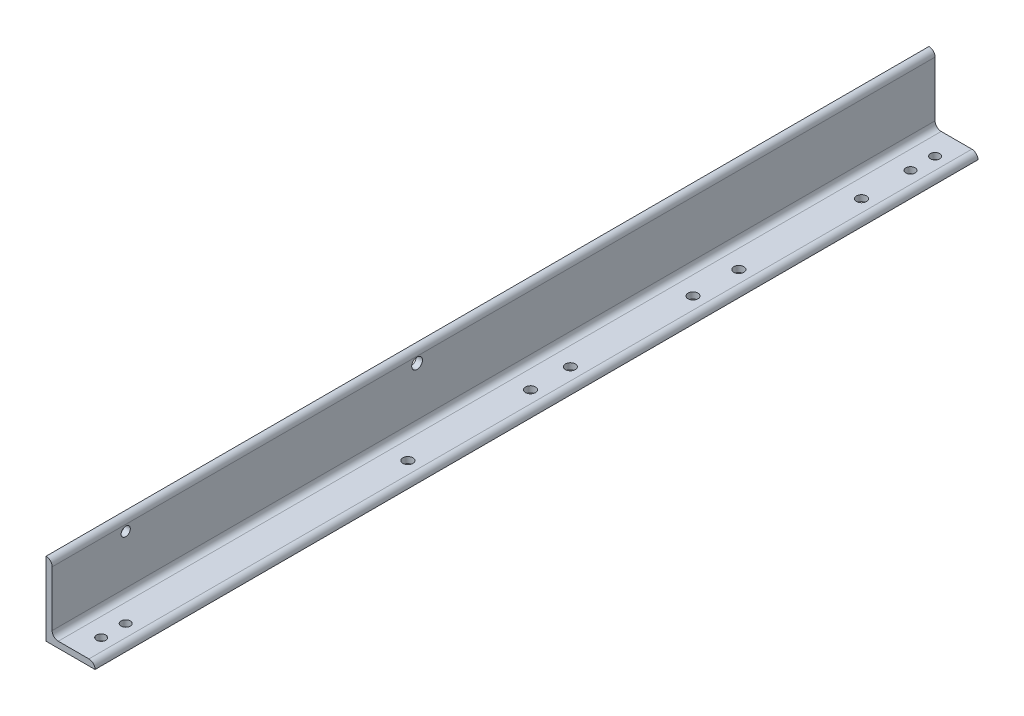
ISO-10303-21;
HEADER;
FILE_DESCRIPTION(('STEP AP214'),'2;1');
FILE_NAME('part.step','',(''),(''),'','','');
FILE_SCHEMA(('AUTOMOTIVE_DESIGN { 1 0 10303 214 1 1 1 1 }'));
ENDSEC;
DATA;
#1=APPLICATION_CONTEXT('core data for automotive mechanical design processes');
#2=APPLICATION_PROTOCOL_DEFINITION('international standard','automotive_design',2000,#1);
#3=PRODUCT_CONTEXT('',#1,'mechanical');
#4=PRODUCT('Part','Part','',(#3));
#5=PRODUCT_RELATED_PRODUCT_CATEGORY('part','',(#4));
#6=PRODUCT_DEFINITION_FORMATION('','',#4);
#7=PRODUCT_DEFINITION_CONTEXT('part definition',#1,'design');
#8=PRODUCT_DEFINITION('design','',#6,#7);
#9=PRODUCT_DEFINITION_SHAPE('','',#8);
#10=(LENGTH_UNIT() NAMED_UNIT(*) SI_UNIT(.MILLI.,.METRE.));
#11=(NAMED_UNIT(*) PLANE_ANGLE_UNIT() SI_UNIT($,.RADIAN.));
#12=(NAMED_UNIT(*) SI_UNIT($,.STERADIAN.) SOLID_ANGLE_UNIT());
#13=UNCERTAINTY_MEASURE_WITH_UNIT(LENGTH_MEASURE(1.E-05),#10,'distance_accuracy_value','');
#14=(GEOMETRIC_REPRESENTATION_CONTEXT(3) GLOBAL_UNCERTAINTY_ASSIGNED_CONTEXT((#13)) GLOBAL_UNIT_ASSIGNED_CONTEXT((#10,
#11,#12)) REPRESENTATION_CONTEXT('',''));
#15=CARTESIAN_POINT('',(0.,0.,0.));
#16=DIRECTION('',(0.,0.,1.));
#17=DIRECTION('',(1.,0.,0.));
#18=AXIS2_PLACEMENT_3D('',#15,#16,#17);
#19=CARTESIAN_POINT('',(101.6,0.,914.4));
#20=DIRECTION('',(0.,1.,0.));
#21=DIRECTION('',(-1.,0.,0.));
#22=AXIS2_PLACEMENT_3D('',#19,#20,#21);
#23=PLANE('',#22);
#24=CARTESIAN_POINT('',(63.5,0.,-812.8));
#25=DIRECTION('',(0.,1.,0.));
#26=DIRECTION('',(-1.,0.,0.));
#27=AXIS2_PLACEMENT_3D('',#24,#25,#26);
#28=CIRCLE('',#27,9.525);
#29=CARTESIAN_POINT('',(53.975,0.,-812.8));
#30=VERTEX_POINT('',#29);
#31=EDGE_CURVE('E248',#30,#30,#28,.F.);
#32=ORIENTED_EDGE('',*,*,#31,.F.);
#33=EDGE_LOOP('',(#32));
#34=FACE_BOUND('',#33,.T.);
#35=CARTESIAN_POINT('',(63.5,0.,812.8));
#36=DIRECTION('',(0.,1.,0.));
#37=DIRECTION('',(-1.,0.,0.));
#38=AXIS2_PLACEMENT_3D('',#35,#36,#37);
#39=CIRCLE('',#38,9.525);
#40=CARTESIAN_POINT('',(53.975,0.,812.8));
#41=VERTEX_POINT('',#40);
#42=EDGE_CURVE('E242',#41,#41,#39,.F.);
#43=ORIENTED_EDGE('',*,*,#42,.F.);
#44=EDGE_LOOP('',(#43));
#45=FACE_BOUND('',#44,.T.);
#46=CARTESIAN_POINT('',(63.5,0.,-108.204));
#47=DIRECTION('',(0.,1.,0.));
#48=DIRECTION('',(-1.,0.,0.));
#49=AXIS2_PLACEMENT_3D('',#46,#47,#48);
#50=CIRCLE('',#49,10.31875);
#51=CARTESIAN_POINT('',(53.18125,0.,-108.204));
#52=VERTEX_POINT('',#51);
#53=EDGE_CURVE('E236',#52,#52,#50,.F.);
#54=ORIENTED_EDGE('',*,*,#53,.F.);
#55=EDGE_LOOP('',(#54));
#56=FACE_BOUND('',#55,.T.);
#57=CARTESIAN_POINT('',(63.5,0.,-362.204));
#58=DIRECTION('',(0.,1.,0.));
#59=DIRECTION('',(-1.,0.,0.));
#60=AXIS2_PLACEMENT_3D('',#57,#58,#59);
#61=CIRCLE('',#60,10.31875);
#62=CARTESIAN_POINT('',(53.18125,0.,-362.204));
#63=VERTEX_POINT('',#62);
#64=EDGE_CURVE('E230',#63,#63,#61,.F.);
#65=ORIENTED_EDGE('',*,*,#64,.F.);
#66=EDGE_LOOP('',(#65));
#67=FACE_BOUND('',#66,.T.);
#68=CARTESIAN_POINT('',(63.5,0.,228.346));
#69=DIRECTION('',(0.,1.,0.));
#70=DIRECTION('',(-1.,0.,0.));
#71=AXIS2_PLACEMENT_3D('',#68,#69,#70);
#72=CIRCLE('',#71,10.31875);
#73=CARTESIAN_POINT('',(53.18125,0.,228.346));
#74=VERTEX_POINT('',#73);
#75=EDGE_CURVE('E224',#74,#74,#72,.F.);
#76=ORIENTED_EDGE('',*,*,#75,.F.);
#77=EDGE_LOOP('',(#76));
#78=FACE_BOUND('',#77,.T.);
#79=CARTESIAN_POINT('',(63.5,0.,-457.2));
#80=DIRECTION('',(0.,1.,0.));
#81=DIRECTION('',(-1.,0.,0.));
#82=AXIS2_PLACEMENT_3D('',#79,#80,#81);
#83=CIRCLE('',#82,10.31875);
#84=CARTESIAN_POINT('',(53.18125,0.,-457.2));
#85=VERTEX_POINT('',#84);
#86=EDGE_CURVE('E218',#85,#85,#83,.F.);
#87=ORIENTED_EDGE('',*,*,#86,.F.);
#88=EDGE_LOOP('',(#87));
#89=FACE_BOUND('',#88,.T.);
#90=CARTESIAN_POINT('',(63.5,0.,-711.2));
#91=DIRECTION('',(0.,1.,0.));
#92=DIRECTION('',(-1.,0.,0.));
#93=AXIS2_PLACEMENT_3D('',#90,#91,#92);
#94=CIRCLE('',#93,10.31875);
#95=CARTESIAN_POINT('',(53.18125,0.,-711.2));
#96=VERTEX_POINT('',#95);
#97=EDGE_CURVE('E212',#96,#96,#94,.F.);
#98=ORIENTED_EDGE('',*,*,#97,.F.);
#99=EDGE_LOOP('',(#98));
#100=FACE_BOUND('',#99,.T.);
#101=CARTESIAN_POINT('',(63.5,0.,-25.654));
#102=DIRECTION('',(0.,1.,0.));
#103=DIRECTION('',(-1.,0.,0.));
#104=AXIS2_PLACEMENT_3D('',#101,#102,#103);
#105=CIRCLE('',#104,10.31875);
#106=CARTESIAN_POINT('',(53.18125,0.,-25.654));
#107=VERTEX_POINT('',#106);
#108=EDGE_CURVE('E206',#107,#107,#105,.F.);
#109=ORIENTED_EDGE('',*,*,#108,.F.);
#110=EDGE_LOOP('',(#109));
#111=FACE_BOUND('',#110,.T.);
#112=CARTESIAN_POINT('',(63.5,0.,-863.6));
#113=DIRECTION('',(0.,1.,0.));
#114=DIRECTION('',(-1.,0.,0.));
#115=AXIS2_PLACEMENT_3D('',#112,#113,#114);
#116=CIRCLE('',#115,9.525);
#117=CARTESIAN_POINT('',(53.975,0.,-863.6));
#118=VERTEX_POINT('',#117);
#119=EDGE_CURVE('E200',#118,#118,#116,.F.);
#120=ORIENTED_EDGE('',*,*,#119,.F.);
#121=EDGE_LOOP('',(#120));
#122=FACE_BOUND('',#121,.T.);
#123=CARTESIAN_POINT('',(63.5,0.,863.6));
#124=DIRECTION('',(0.,1.,0.));
#125=DIRECTION('',(-1.,0.,0.));
#126=AXIS2_PLACEMENT_3D('',#123,#124,#125);
#127=CIRCLE('',#126,9.525);
#128=CARTESIAN_POINT('',(53.975,0.,863.6));
#129=VERTEX_POINT('',#128);
#130=EDGE_CURVE('E141',#129,#129,#127,.F.);
#131=ORIENTED_EDGE('',*,*,#130,.F.);
#132=EDGE_LOOP('',(#131));
#133=FACE_BOUND('',#132,.T.);
#134=DIRECTION('',(1.,0.,0.));
#135=VECTOR('',#134,1.);
#136=CARTESIAN_POINT('',(101.6,0.,-914.4));
#137=LINE('',#136,#135);
#138=CARTESIAN_POINT('',(0.,0.,-914.4));
#139=VERTEX_POINT('',#138);
#140=CARTESIAN_POINT('',(101.6,0.,-914.4));
#141=VERTEX_POINT('',#140);
#142=EDGE_CURVE('E137',#139,#141,#137,.T.);
#143=ORIENTED_EDGE('',*,*,#142,.T.);
#144=DIRECTION('',(0.,0.,-1.));
#145=VECTOR('',#144,1.);
#146=CARTESIAN_POINT('',(101.6,0.,914.4));
#147=LINE('',#146,#145);
#148=CARTESIAN_POINT('',(101.6,0.,914.4));
#149=VERTEX_POINT('',#148);
#150=EDGE_CURVE('E11',#149,#141,#147,.T.);
#151=ORIENTED_EDGE('',*,*,#150,.F.);
#152=DIRECTION('',(1.,0.,0.));
#153=VECTOR('',#152,1.);
#154=CARTESIAN_POINT('',(101.6,0.,914.4));
#155=LINE('',#154,#153);
#156=CARTESIAN_POINT('',(0.,0.,914.4));
#157=VERTEX_POINT('',#156);
#158=EDGE_CURVE('E154',#157,#149,#155,.T.);
#159=ORIENTED_EDGE('',*,*,#158,.F.);
#160=DIRECTION('',(0.,0.,-1.));
#161=VECTOR('',#160,1.);
#162=CARTESIAN_POINT('',(0.,0.,914.4));
#163=LINE('',#162,#161);
#164=EDGE_CURVE('E133',#157,#139,#163,.T.);
#165=ORIENTED_EDGE('',*,*,#164,.T.);
#166=EDGE_LOOP('',(#143,#151,#159,#165));
#167=FACE_BOUND('',#166,.T.);
#168=ADVANCED_FACE('F35',(#34,#45,#56,#67,#78,#89,#100,#111,#122,#133,#167),#23,.F.);
#169=CARTESIAN_POINT('',(101.6,0.00508000000000453,914.4));
#170=DIRECTION('',(-1.,0.,0.));
#171=DIRECTION('',(0.,0.,1.));
#172=AXIS2_PLACEMENT_3D('',#169,#170,#171);
#173=PLANE('',#172);
#174=DIRECTION('',(0.,1.,0.));
#175=VECTOR('',#174,1.);
#176=CARTESIAN_POINT('',(101.6,0.00508000000000453,-914.4));
#177=LINE('',#176,#175);
#178=CARTESIAN_POINT('',(101.6,0.00508000000000453,-914.4));
#179=VERTEX_POINT('',#178);
#180=EDGE_CURVE('E140',#141,#179,#177,.T.);
#181=ORIENTED_EDGE('',*,*,#180,.T.);
#182=DIRECTION('',(0.,0.,-1.));
#183=VECTOR('',#182,1.);
#184=CARTESIAN_POINT('',(101.6,0.00508000000000453,914.4));
#185=LINE('',#184,#183);
#186=CARTESIAN_POINT('',(101.6,0.00508000000000453,914.4));
#187=VERTEX_POINT('',#186);
#188=EDGE_CURVE('E43',#187,#179,#185,.T.);
#189=ORIENTED_EDGE('',*,*,#188,.F.);
#190=DIRECTION('',(0.,1.,0.));
#191=VECTOR('',#190,1.);
#192=CARTESIAN_POINT('',(101.6,0.00508000000000453,914.4));
#193=LINE('',#192,#191);
#194=EDGE_CURVE('E97',#149,#187,#193,.T.);
#195=ORIENTED_EDGE('',*,*,#194,.F.);
#196=ORIENTED_EDGE('',*,*,#150,.T.);
#197=EDGE_LOOP('',(#181,#189,#195,#196));
#198=FACE_BOUND('',#197,.T.);
#199=ADVANCED_FACE('F296',(#198),#173,.F.);
#200=CARTESIAN_POINT('',(88.90508,0.00508000000000453,914.4));
#201=DIRECTION('',(0.,0.,-1.));
#202=DIRECTION('',(-1.,0.,0.));
#203=AXIS2_PLACEMENT_3D('',#200,#201,#202);
#204=CYLINDRICAL_SURFACE('',#203,12.69492);
#205=CARTESIAN_POINT('',(88.90508,0.00508000000000453,-914.4));
#206=DIRECTION('',(0.,0.,1.));
#207=DIRECTION('',(1.,0.,0.));
#208=AXIS2_PLACEMENT_3D('',#205,#206,#207);
#209=CIRCLE('',#208,12.69492);
#210=CARTESIAN_POINT('',(88.90508,12.7,-914.4));
#211=VERTEX_POINT('',#210);
#212=EDGE_CURVE('E143',#179,#211,#209,.T.);
#213=ORIENTED_EDGE('',*,*,#212,.T.);
#214=DIRECTION('',(0.,0.,-1.));
#215=VECTOR('',#214,1.);
#216=CARTESIAN_POINT('',(88.90508,12.7,914.4));
#217=LINE('',#216,#215);
#218=CARTESIAN_POINT('',(88.90508,12.7,914.4));
#219=VERTEX_POINT('',#218);
#220=EDGE_CURVE('E164',#219,#211,#217,.T.);
#221=ORIENTED_EDGE('',*,*,#220,.F.);
#222=CARTESIAN_POINT('',(88.90508,0.00508000000000453,914.4));
#223=DIRECTION('',(0.,0.,1.));
#224=DIRECTION('',(1.,0.,0.));
#225=AXIS2_PLACEMENT_3D('',#222,#223,#224);
#226=CIRCLE('',#225,12.69492);
#227=EDGE_CURVE('E172',#187,#219,#226,.T.);
#228=ORIENTED_EDGE('',*,*,#227,.F.);
#229=ORIENTED_EDGE('',*,*,#188,.T.);
#230=EDGE_LOOP('',(#213,#221,#228,#229));
#231=FACE_BOUND('',#230,.T.);
#232=ADVANCED_FACE('F170',(#231),#204,.T.);
#233=CARTESIAN_POINT('',(25.4,12.7,914.4));
#234=DIRECTION('',(0.,-1.,0.));
#235=DIRECTION('',(0.,0.,-1.));
#236=AXIS2_PLACEMENT_3D('',#233,#234,#235);
#237=PLANE('',#236);
#238=CARTESIAN_POINT('',(63.5,12.7,-812.8));
#239=DIRECTION('',(0.,1.,0.));
#240=DIRECTION('',(-1.,0.,0.));
#241=AXIS2_PLACEMENT_3D('',#238,#239,#240);
#242=CIRCLE('',#241,9.525);
#243=CARTESIAN_POINT('',(53.975,12.7,-812.8));
#244=VERTEX_POINT('',#243);
#245=EDGE_CURVE('E251',#244,#244,#242,.T.);
#246=ORIENTED_EDGE('',*,*,#245,.F.);
#247=EDGE_LOOP('',(#246));
#248=FACE_BOUND('',#247,.T.);
#249=CARTESIAN_POINT('',(63.5,12.7,812.8));
#250=DIRECTION('',(0.,1.,0.));
#251=DIRECTION('',(-1.,0.,0.));
#252=AXIS2_PLACEMENT_3D('',#249,#250,#251);
#253=CIRCLE('',#252,9.525);
#254=CARTESIAN_POINT('',(53.975,12.7,812.8));
#255=VERTEX_POINT('',#254);
#256=EDGE_CURVE('E245',#255,#255,#253,.T.);
#257=ORIENTED_EDGE('',*,*,#256,.F.);
#258=EDGE_LOOP('',(#257));
#259=FACE_BOUND('',#258,.T.);
#260=CARTESIAN_POINT('',(63.5,12.7,-108.204));
#261=DIRECTION('',(0.,1.,0.));
#262=DIRECTION('',(-1.,0.,0.));
#263=AXIS2_PLACEMENT_3D('',#260,#261,#262);
#264=CIRCLE('',#263,10.31875);
#265=CARTESIAN_POINT('',(53.18125,12.7,-108.204));
#266=VERTEX_POINT('',#265);
#267=EDGE_CURVE('E239',#266,#266,#264,.T.);
#268=ORIENTED_EDGE('',*,*,#267,.F.);
#269=EDGE_LOOP('',(#268));
#270=FACE_BOUND('',#269,.T.);
#271=CARTESIAN_POINT('',(63.5,12.7,-362.204));
#272=DIRECTION('',(0.,1.,0.));
#273=DIRECTION('',(-1.,0.,0.));
#274=AXIS2_PLACEMENT_3D('',#271,#272,#273);
#275=CIRCLE('',#274,10.31875);
#276=CARTESIAN_POINT('',(53.18125,12.7,-362.204));
#277=VERTEX_POINT('',#276);
#278=EDGE_CURVE('E233',#277,#277,#275,.T.);
#279=ORIENTED_EDGE('',*,*,#278,.F.);
#280=EDGE_LOOP('',(#279));
#281=FACE_BOUND('',#280,.T.);
#282=CARTESIAN_POINT('',(63.5,12.7,228.346));
#283=DIRECTION('',(0.,1.,0.));
#284=DIRECTION('',(-1.,0.,0.));
#285=AXIS2_PLACEMENT_3D('',#282,#283,#284);
#286=CIRCLE('',#285,10.31875);
#287=CARTESIAN_POINT('',(53.18125,12.7,228.346));
#288=VERTEX_POINT('',#287);
#289=EDGE_CURVE('E227',#288,#288,#286,.T.);
#290=ORIENTED_EDGE('',*,*,#289,.F.);
#291=EDGE_LOOP('',(#290));
#292=FACE_BOUND('',#291,.T.);
#293=CARTESIAN_POINT('',(63.5,12.7,-457.2));
#294=DIRECTION('',(0.,1.,0.));
#295=DIRECTION('',(-1.,0.,0.));
#296=AXIS2_PLACEMENT_3D('',#293,#294,#295);
#297=CIRCLE('',#296,10.31875);
#298=CARTESIAN_POINT('',(53.18125,12.7,-457.2));
#299=VERTEX_POINT('',#298);
#300=EDGE_CURVE('E221',#299,#299,#297,.T.);
#301=ORIENTED_EDGE('',*,*,#300,.F.);
#302=EDGE_LOOP('',(#301));
#303=FACE_BOUND('',#302,.T.);
#304=CARTESIAN_POINT('',(63.5,12.7,-711.2));
#305=DIRECTION('',(0.,1.,0.));
#306=DIRECTION('',(-1.,0.,0.));
#307=AXIS2_PLACEMENT_3D('',#304,#305,#306);
#308=CIRCLE('',#307,10.31875);
#309=CARTESIAN_POINT('',(53.18125,12.7,-711.2));
#310=VERTEX_POINT('',#309);
#311=EDGE_CURVE('E215',#310,#310,#308,.T.);
#312=ORIENTED_EDGE('',*,*,#311,.F.);
#313=EDGE_LOOP('',(#312));
#314=FACE_BOUND('',#313,.T.);
#315=CARTESIAN_POINT('',(63.5,12.7,-25.654));
#316=DIRECTION('',(0.,1.,0.));
#317=DIRECTION('',(-1.,0.,0.));
#318=AXIS2_PLACEMENT_3D('',#315,#316,#317);
#319=CIRCLE('',#318,10.31875);
#320=CARTESIAN_POINT('',(53.18125,12.7,-25.654));
#321=VERTEX_POINT('',#320);
#322=EDGE_CURVE('E209',#321,#321,#319,.T.);
#323=ORIENTED_EDGE('',*,*,#322,.F.);
#324=EDGE_LOOP('',(#323));
#325=FACE_BOUND('',#324,.T.);
#326=CARTESIAN_POINT('',(63.5,12.7,-863.6));
#327=DIRECTION('',(0.,1.,0.));
#328=DIRECTION('',(-1.,0.,0.));
#329=AXIS2_PLACEMENT_3D('',#326,#327,#328);
#330=CIRCLE('',#329,9.525);
#331=CARTESIAN_POINT('',(53.975,12.7,-863.6));
#332=VERTEX_POINT('',#331);
#333=EDGE_CURVE('E203',#332,#332,#330,.T.);
#334=ORIENTED_EDGE('',*,*,#333,.F.);
#335=EDGE_LOOP('',(#334));
#336=FACE_BOUND('',#335,.T.);
#337=CARTESIAN_POINT('',(63.5,12.7,863.6));
#338=DIRECTION('',(0.,1.,0.));
#339=DIRECTION('',(-1.,0.,0.));
#340=AXIS2_PLACEMENT_3D('',#337,#338,#339);
#341=CIRCLE('',#340,9.525);
#342=CARTESIAN_POINT('',(53.975,12.7,863.6));
#343=VERTEX_POINT('',#342);
#344=EDGE_CURVE('E197',#343,#343,#341,.T.);
#345=ORIENTED_EDGE('',*,*,#344,.F.);
#346=EDGE_LOOP('',(#345));
#347=FACE_BOUND('',#346,.T.);
#348=DIRECTION('',(-1.,0.,0.));
#349=VECTOR('',#348,1.);
#350=CARTESIAN_POINT('',(25.4,12.7,-914.4));
#351=LINE('',#350,#349);
#352=CARTESIAN_POINT('',(25.4,12.7,-914.4));
#353=VERTEX_POINT('',#352);
#354=EDGE_CURVE('E145',#211,#353,#351,.T.);
#355=ORIENTED_EDGE('',*,*,#354,.T.);
#356=DIRECTION('',(0.,0.,-1.));
#357=VECTOR('',#356,1.);
#358=CARTESIAN_POINT('',(25.4,12.7,914.4));
#359=LINE('',#358,#357);
#360=CARTESIAN_POINT('',(25.4,12.7,914.4));
#361=VERTEX_POINT('',#360);
#362=EDGE_CURVE('E161',#361,#353,#359,.T.);
#363=ORIENTED_EDGE('',*,*,#362,.F.);
#364=DIRECTION('',(-1.,0.,0.));
#365=VECTOR('',#364,1.);
#366=CARTESIAN_POINT('',(25.4,12.7,914.4));
#367=LINE('',#366,#365);
#368=EDGE_CURVE('E188',#219,#361,#367,.T.);
#369=ORIENTED_EDGE('',*,*,#368,.F.);
#370=ORIENTED_EDGE('',*,*,#220,.T.);
#371=EDGE_LOOP('',(#355,#363,#369,#370));
#372=FACE_BOUND('',#371,.T.);
#373=ADVANCED_FACE('F181',(#248,#259,#270,#281,#292,#303,#314,#325,#336,#347,#372),#237,.F.);
#374=CARTESIAN_POINT('',(25.4,25.4,914.4));
#375=DIRECTION('',(0.,0.,-1.));
#376=DIRECTION('',(-1.,0.,0.));
#377=AXIS2_PLACEMENT_3D('',#374,#375,#376);
#378=CYLINDRICAL_SURFACE('',#377,12.7);
#379=CARTESIAN_POINT('',(25.4,25.4,-914.4));
#380=DIRECTION('',(0.,0.,-1.));
#381=DIRECTION('',(-1.,0.,0.));
#382=AXIS2_PLACEMENT_3D('',#379,#380,#381);
#383=CIRCLE('',#382,12.7);
#384=CARTESIAN_POINT('',(12.7,25.4,-914.4));
#385=VERTEX_POINT('',#384);
#386=EDGE_CURVE('E147',#353,#385,#383,.T.);
#387=ORIENTED_EDGE('',*,*,#386,.T.);
#388=DIRECTION('',(0.,0.,-1.));
#389=VECTOR('',#388,1.);
#390=CARTESIAN_POINT('',(12.7,25.4,914.4));
#391=LINE('',#390,#389);
#392=CARTESIAN_POINT('',(12.7,25.4,914.4));
#393=VERTEX_POINT('',#392);
#394=EDGE_CURVE('E158',#393,#385,#391,.T.);
#395=ORIENTED_EDGE('',*,*,#394,.F.);
#396=CARTESIAN_POINT('',(25.4,25.4,914.4));
#397=DIRECTION('',(0.,0.,-1.));
#398=DIRECTION('',(-1.,0.,0.));
#399=AXIS2_PLACEMENT_3D('',#396,#397,#398);
#400=CIRCLE('',#399,12.7);
#401=EDGE_CURVE('E187',#361,#393,#400,.T.);
#402=ORIENTED_EDGE('',*,*,#401,.F.);
#403=ORIENTED_EDGE('',*,*,#362,.T.);
#404=EDGE_LOOP('',(#387,#395,#402,#403));
#405=FACE_BOUND('',#404,.T.);
#406=ADVANCED_FACE('F185',(#405),#378,.F.);
#407=CARTESIAN_POINT('',(12.7,139.70508,914.4));
#408=DIRECTION('',(-1.,0.,0.));
#409=DIRECTION('',(0.,-1.,0.));
#410=AXIS2_PLACEMENT_3D('',#407,#408,#409);
#411=PLANE('',#410);
#412=CARTESIAN_POINT('',(12.7,127.,158.496));
#413=DIRECTION('',(1.,0.,0.));
#414=DIRECTION('',(0.,1.,0.));
#415=AXIS2_PLACEMENT_3D('',#412,#413,#414);
#416=CIRCLE('',#415,11.1125);
#417=CARTESIAN_POINT('',(12.7,138.1125,158.496));
#418=VERTEX_POINT('',#417);
#419=EDGE_CURVE('E261',#418,#418,#416,.T.);
#420=ORIENTED_EDGE('',*,*,#419,.F.);
#421=EDGE_LOOP('',(#420));
#422=FACE_BOUND('',#421,.T.);
#423=CARTESIAN_POINT('',(12.7,127.,762.));
#424=DIRECTION('',(1.,0.,0.));
#425=DIRECTION('',(0.,0.,-1.));
#426=AXIS2_PLACEMENT_3D('',#423,#424,#425);
#427=CIRCLE('',#426,9.52499999999998);
#428=CARTESIAN_POINT('',(12.7,127.,752.475));
#429=VERTEX_POINT('',#428);
#430=EDGE_CURVE('E257',#429,#429,#427,.T.);
#431=ORIENTED_EDGE('',*,*,#430,.F.);
#432=EDGE_LOOP('',(#431));
#433=FACE_BOUND('',#432,.T.);
#434=DIRECTION('',(0.,1.,0.));
#435=VECTOR('',#434,1.);
#436=CARTESIAN_POINT('',(12.7,139.70508,-914.4));
#437=LINE('',#436,#435);
#438=CARTESIAN_POINT('',(12.7,139.70508,-914.4));
#439=VERTEX_POINT('',#438);
#440=EDGE_CURVE('E149',#385,#439,#437,.T.);
#441=ORIENTED_EDGE('',*,*,#440,.T.);
#442=DIRECTION('',(0.,0.,-1.));
#443=VECTOR('',#442,1.);
#444=CARTESIAN_POINT('',(12.7,139.70508,914.4));
#445=LINE('',#444,#443);
#446=CARTESIAN_POINT('',(12.7,139.70508,914.4));
#447=VERTEX_POINT('',#446);
#448=EDGE_CURVE('E128',#447,#439,#445,.T.);
#449=ORIENTED_EDGE('',*,*,#448,.F.);
#450=DIRECTION('',(0.,1.,0.));
#451=VECTOR('',#450,1.);
#452=CARTESIAN_POINT('',(12.7,139.70508,914.4));
#453=LINE('',#452,#451);
#454=EDGE_CURVE('E119',#393,#447,#453,.T.);
#455=ORIENTED_EDGE('',*,*,#454,.F.);
#456=ORIENTED_EDGE('',*,*,#394,.T.);
#457=EDGE_LOOP('',(#441,#449,#455,#456));
#458=FACE_BOUND('',#457,.T.);
#459=ADVANCED_FACE('F277',(#422,#433,#458),#411,.F.);
#460=CARTESIAN_POINT('',(0.00508000000000078,139.70508,914.4));
#461=DIRECTION('',(0.,0.,-1.));
#462=DIRECTION('',(-1.,0.,0.));
#463=AXIS2_PLACEMENT_3D('',#460,#461,#462);
#464=CYLINDRICAL_SURFACE('',#463,12.69492);
#465=CARTESIAN_POINT('',(0.00508000000000078,139.70508,-914.4));
#466=DIRECTION('',(0.,0.,1.));
#467=DIRECTION('',(-1.,0.,0.));
#468=AXIS2_PLACEMENT_3D('',#465,#466,#467);
#469=CIRCLE('',#468,12.69492);
#470=CARTESIAN_POINT('',(0.00508,152.4,-914.4));
#471=VERTEX_POINT('',#470);
#472=EDGE_CURVE('E127',#439,#471,#469,.T.);
#473=ORIENTED_EDGE('',*,*,#472,.T.);
#474=DIRECTION('',(0.,0.,-1.));
#475=VECTOR('',#474,1.);
#476=CARTESIAN_POINT('',(0.00508,152.4,914.4));
#477=LINE('',#476,#475);
#478=CARTESIAN_POINT('',(0.00508,152.4,914.4));
#479=VERTEX_POINT('',#478);
#480=EDGE_CURVE('E124',#479,#471,#477,.T.);
#481=ORIENTED_EDGE('',*,*,#480,.F.);
#482=CARTESIAN_POINT('',(0.00508000000000078,139.70508,914.4));
#483=DIRECTION('',(0.,0.,1.));
#484=DIRECTION('',(-1.,0.,0.));
#485=AXIS2_PLACEMENT_3D('',#482,#483,#484);
#486=CIRCLE('',#485,12.69492);
#487=EDGE_CURVE('E113',#447,#479,#486,.T.);
#488=ORIENTED_EDGE('',*,*,#487,.F.);
#489=ORIENTED_EDGE('',*,*,#448,.T.);
#490=EDGE_LOOP('',(#473,#481,#488,#489));
#491=FACE_BOUND('',#490,.T.);
#492=ADVANCED_FACE('F125',(#491),#464,.T.);
#493=CARTESIAN_POINT('',(0.,152.4,914.4));
#494=DIRECTION('',(0.,-1.,0.));
#495=DIRECTION('',(0.,0.,-1.));
#496=AXIS2_PLACEMENT_3D('',#493,#494,#495);
#497=PLANE('',#496);
#498=DIRECTION('',(-1.,0.,0.));
#499=VECTOR('',#498,1.);
#500=CARTESIAN_POINT('',(0.,152.4,-914.4));
#501=LINE('',#500,#499);
#502=CARTESIAN_POINT('',(0.,152.4,-914.4));
#503=VERTEX_POINT('',#502);
#504=EDGE_CURVE('E83',#471,#503,#501,.T.);
#505=ORIENTED_EDGE('',*,*,#504,.T.);
#506=DIRECTION('',(0.,0.,-1.));
#507=VECTOR('',#506,1.);
#508=CARTESIAN_POINT('',(0.,152.4,914.4));
#509=LINE('',#508,#507);
#510=CARTESIAN_POINT('',(0.,152.4,914.4));
#511=VERTEX_POINT('',#510);
#512=EDGE_CURVE('E129',#511,#503,#509,.T.);
#513=ORIENTED_EDGE('',*,*,#512,.F.);
#514=DIRECTION('',(-1.,0.,0.));
#515=VECTOR('',#514,1.);
#516=CARTESIAN_POINT('',(0.,152.4,914.4));
#517=LINE('',#516,#515);
#518=EDGE_CURVE('E117',#479,#511,#517,.T.);
#519=ORIENTED_EDGE('',*,*,#518,.F.);
#520=ORIENTED_EDGE('',*,*,#480,.T.);
#521=EDGE_LOOP('',(#505,#513,#519,#520));
#522=FACE_BOUND('',#521,.T.);
#523=ADVANCED_FACE('F131',(#522),#497,.F.);
#524=CARTESIAN_POINT('',(0.,0.,914.4));
#525=DIRECTION('',(1.,0.,0.));
#526=DIRECTION('',(0.,0.,-1.));
#527=AXIS2_PLACEMENT_3D('',#524,#525,#526);
#528=PLANE('',#527);
#529=CARTESIAN_POINT('',(0.,127.,158.496));
#530=DIRECTION('',(1.,0.,0.));
#531=DIRECTION('',(0.,1.,0.));
#532=AXIS2_PLACEMENT_3D('',#529,#530,#531);
#533=CIRCLE('',#532,11.1125);
#534=CARTESIAN_POINT('',(0.,138.1125,158.496));
#535=VERTEX_POINT('',#534);
#536=EDGE_CURVE('E260',#535,#535,#533,.T.);
#537=ORIENTED_EDGE('',*,*,#536,.T.);
#538=EDGE_LOOP('',(#537));
#539=FACE_BOUND('',#538,.T.);
#540=CARTESIAN_POINT('',(0.,127.,762.));
#541=DIRECTION('',(1.,0.,0.));
#542=DIRECTION('',(0.,0.,-1.));
#543=AXIS2_PLACEMENT_3D('',#540,#541,#542);
#544=CIRCLE('',#543,9.52499999999999);
#545=CARTESIAN_POINT('',(0.,127.,752.475));
#546=VERTEX_POINT('',#545);
#547=EDGE_CURVE('E254',#546,#546,#544,.T.);
#548=ORIENTED_EDGE('',*,*,#547,.T.);
#549=EDGE_LOOP('',(#548));
#550=FACE_BOUND('',#549,.T.);
#551=DIRECTION('',(0.,-1.,0.));
#552=VECTOR('',#551,1.);
#553=CARTESIAN_POINT('',(0.,0.,-914.4));
#554=LINE('',#553,#552);
#555=EDGE_CURVE('E89',#503,#139,#554,.T.);
#556=ORIENTED_EDGE('',*,*,#555,.T.);
#557=ORIENTED_EDGE('',*,*,#164,.F.);
#558=DIRECTION('',(0.,-1.,0.));
#559=VECTOR('',#558,1.);
#560=CARTESIAN_POINT('',(0.,0.,914.4));
#561=LINE('',#560,#559);
#562=EDGE_CURVE('E51',#511,#157,#561,.T.);
#563=ORIENTED_EDGE('',*,*,#562,.F.);
#564=ORIENTED_EDGE('',*,*,#512,.T.);
#565=EDGE_LOOP('',(#556,#557,#563,#564));
#566=FACE_BOUND('',#565,.T.);
#567=ADVANCED_FACE('F267',(#539,#550,#566),#528,.F.);
#568=CARTESIAN_POINT('',(0.00508000000000078,139.70508,914.4));
#569=DIRECTION('',(0.,0.,-1.));
#570=DIRECTION('',(-1.,0.,0.));
#571=AXIS2_PLACEMENT_3D('',#568,#569,#570);
#572=PLANE('',#571);
#573=ORIENTED_EDGE('',*,*,#158,.T.);
#574=ORIENTED_EDGE('',*,*,#194,.T.);
#575=ORIENTED_EDGE('',*,*,#227,.T.);
#576=ORIENTED_EDGE('',*,*,#368,.T.);
#577=ORIENTED_EDGE('',*,*,#401,.T.);
#578=ORIENTED_EDGE('',*,*,#454,.T.);
#579=ORIENTED_EDGE('',*,*,#487,.T.);
#580=ORIENTED_EDGE('',*,*,#518,.T.);
#581=ORIENTED_EDGE('',*,*,#562,.T.);
#582=EDGE_LOOP('',(#573,#574,#575,#576,#577,#578,#579,#580,#581));
#583=FACE_BOUND('',#582,.T.);
#584=ADVANCED_FACE('F115',(#583),#572,.F.);
#585=CARTESIAN_POINT('',(0.00508000000000078,139.70508,-914.4));
#586=DIRECTION('',(0.,0.,-1.));
#587=DIRECTION('',(-1.,0.,0.));
#588=AXIS2_PLACEMENT_3D('',#585,#586,#587);
#589=PLANE('',#588);
#590=ORIENTED_EDGE('',*,*,#142,.F.);
#591=ORIENTED_EDGE('',*,*,#555,.F.);
#592=ORIENTED_EDGE('',*,*,#504,.F.);
#593=ORIENTED_EDGE('',*,*,#472,.F.);
#594=ORIENTED_EDGE('',*,*,#440,.F.);
#595=ORIENTED_EDGE('',*,*,#386,.F.);
#596=ORIENTED_EDGE('',*,*,#354,.F.);
#597=ORIENTED_EDGE('',*,*,#212,.F.);
#598=ORIENTED_EDGE('',*,*,#180,.F.);
#599=EDGE_LOOP('',(#590,#591,#592,#593,#594,#595,#596,#597,#598));
#600=FACE_BOUND('',#599,.T.);
#601=ADVANCED_FACE('F176',(#600),#589,.T.);
#602=CARTESIAN_POINT('',(63.5,-0.00100000000000794,863.6));
#603=DIRECTION('',(0.,1.,0.));
#604=DIRECTION('',(-1.,0.,0.));
#605=AXIS2_PLACEMENT_3D('',#602,#603,#604);
#606=CYLINDRICAL_SURFACE('',#605,9.525);
#607=ORIENTED_EDGE('',*,*,#344,.T.);
#608=EDGE_LOOP('',(#607));
#609=FACE_BOUND('',#608,.T.);
#610=ORIENTED_EDGE('',*,*,#130,.T.);
#611=EDGE_LOOP('',(#610));
#612=FACE_BOUND('',#611,.T.);
#613=ADVANCED_FACE('F321',(#609,#612),#606,.F.);
#614=CARTESIAN_POINT('',(63.5,-0.00100000000000794,-863.6));
#615=DIRECTION('',(0.,1.,0.));
#616=DIRECTION('',(-1.,0.,0.));
#617=AXIS2_PLACEMENT_3D('',#614,#615,#616);
#618=CYLINDRICAL_SURFACE('',#617,9.525);
#619=ORIENTED_EDGE('',*,*,#333,.T.);
#620=EDGE_LOOP('',(#619));
#621=FACE_BOUND('',#620,.T.);
#622=ORIENTED_EDGE('',*,*,#119,.T.);
#623=EDGE_LOOP('',(#622));
#624=FACE_BOUND('',#623,.T.);
#625=ADVANCED_FACE('F323',(#621,#624),#618,.F.);
#626=CARTESIAN_POINT('',(63.5,-0.00100000000000794,-25.654));
#627=DIRECTION('',(0.,1.,0.));
#628=DIRECTION('',(-1.,0.,0.));
#629=AXIS2_PLACEMENT_3D('',#626,#627,#628);
#630=CYLINDRICAL_SURFACE('',#629,10.31875);
#631=ORIENTED_EDGE('',*,*,#322,.T.);
#632=EDGE_LOOP('',(#631));
#633=FACE_BOUND('',#632,.T.);
#634=ORIENTED_EDGE('',*,*,#108,.T.);
#635=EDGE_LOOP('',(#634));
#636=FACE_BOUND('',#635,.T.);
#637=ADVANCED_FACE('F330',(#633,#636),#630,.F.);
#638=CARTESIAN_POINT('',(63.5,-0.00100000000000794,-711.2));
#639=DIRECTION('',(0.,1.,0.));
#640=DIRECTION('',(-1.,0.,0.));
#641=AXIS2_PLACEMENT_3D('',#638,#639,#640);
#642=CYLINDRICAL_SURFACE('',#641,10.31875);
#643=ORIENTED_EDGE('',*,*,#311,.T.);
#644=EDGE_LOOP('',(#643));
#645=FACE_BOUND('',#644,.T.);
#646=ORIENTED_EDGE('',*,*,#97,.T.);
#647=EDGE_LOOP('',(#646));
#648=FACE_BOUND('',#647,.T.);
#649=ADVANCED_FACE('F336',(#645,#648),#642,.F.);
#650=CARTESIAN_POINT('',(63.5,-0.00100000000000794,-457.2));
#651=DIRECTION('',(0.,1.,0.));
#652=DIRECTION('',(-1.,0.,0.));
#653=AXIS2_PLACEMENT_3D('',#650,#651,#652);
#654=CYLINDRICAL_SURFACE('',#653,10.31875);
#655=ORIENTED_EDGE('',*,*,#300,.T.);
#656=EDGE_LOOP('',(#655));
#657=FACE_BOUND('',#656,.T.);
#658=ORIENTED_EDGE('',*,*,#86,.T.);
#659=EDGE_LOOP('',(#658));
#660=FACE_BOUND('',#659,.T.);
#661=ADVANCED_FACE('F340',(#657,#660),#654,.F.);
#662=CARTESIAN_POINT('',(63.5,-0.00100000000000794,228.346));
#663=DIRECTION('',(0.,1.,0.));
#664=DIRECTION('',(-1.,0.,0.));
#665=AXIS2_PLACEMENT_3D('',#662,#663,#664);
#666=CYLINDRICAL_SURFACE('',#665,10.31875);
#667=ORIENTED_EDGE('',*,*,#289,.T.);
#668=EDGE_LOOP('',(#667));
#669=FACE_BOUND('',#668,.T.);
#670=ORIENTED_EDGE('',*,*,#75,.T.);
#671=EDGE_LOOP('',(#670));
#672=FACE_BOUND('',#671,.T.);
#673=ADVANCED_FACE('F344',(#669,#672),#666,.F.);
#674=CARTESIAN_POINT('',(63.5,-0.00100000000000794,-362.204));
#675=DIRECTION('',(0.,1.,0.));
#676=DIRECTION('',(-1.,0.,0.));
#677=AXIS2_PLACEMENT_3D('',#674,#675,#676);
#678=CYLINDRICAL_SURFACE('',#677,10.31875);
#679=ORIENTED_EDGE('',*,*,#278,.T.);
#680=EDGE_LOOP('',(#679));
#681=FACE_BOUND('',#680,.T.);
#682=ORIENTED_EDGE('',*,*,#64,.T.);
#683=EDGE_LOOP('',(#682));
#684=FACE_BOUND('',#683,.T.);
#685=ADVANCED_FACE('F348',(#681,#684),#678,.F.);
#686=CARTESIAN_POINT('',(63.5,-0.00100000000000794,-108.204));
#687=DIRECTION('',(0.,1.,0.));
#688=DIRECTION('',(-1.,0.,0.));
#689=AXIS2_PLACEMENT_3D('',#686,#687,#688);
#690=CYLINDRICAL_SURFACE('',#689,10.31875);
#691=ORIENTED_EDGE('',*,*,#267,.T.);
#692=EDGE_LOOP('',(#691));
#693=FACE_BOUND('',#692,.T.);
#694=ORIENTED_EDGE('',*,*,#53,.T.);
#695=EDGE_LOOP('',(#694));
#696=FACE_BOUND('',#695,.T.);
#697=ADVANCED_FACE('F352',(#693,#696),#690,.F.);
#698=CARTESIAN_POINT('',(63.5,-0.00100000000000794,812.8));
#699=DIRECTION('',(0.,1.,0.));
#700=DIRECTION('',(-1.,0.,0.));
#701=AXIS2_PLACEMENT_3D('',#698,#699,#700);
#702=CYLINDRICAL_SURFACE('',#701,9.525);
#703=ORIENTED_EDGE('',*,*,#256,.T.);
#704=EDGE_LOOP('',(#703));
#705=FACE_BOUND('',#704,.T.);
#706=ORIENTED_EDGE('',*,*,#42,.T.);
#707=EDGE_LOOP('',(#706));
#708=FACE_BOUND('',#707,.T.);
#709=ADVANCED_FACE('F356',(#705,#708),#702,.F.);
#710=CARTESIAN_POINT('',(63.5,-0.00100000000000794,-812.8));
#711=DIRECTION('',(0.,1.,0.));
#712=DIRECTION('',(-1.,0.,0.));
#713=AXIS2_PLACEMENT_3D('',#710,#711,#712);
#714=CYLINDRICAL_SURFACE('',#713,9.525);
#715=ORIENTED_EDGE('',*,*,#245,.T.);
#716=EDGE_LOOP('',(#715));
#717=FACE_BOUND('',#716,.T.);
#718=ORIENTED_EDGE('',*,*,#31,.T.);
#719=EDGE_LOOP('',(#718));
#720=FACE_BOUND('',#719,.T.);
#721=ADVANCED_FACE('F360',(#717,#720),#714,.F.);
#722=CARTESIAN_POINT('',(12.7,127.,762.));
#723=DIRECTION('',(1.,0.,0.));
#724=DIRECTION('',(0.,0.,-1.));
#725=AXIS2_PLACEMENT_3D('',#722,#723,#724);
#726=CYLINDRICAL_SURFACE('',#725,9.52499999999999);
#727=ORIENTED_EDGE('',*,*,#547,.F.);
#728=EDGE_LOOP('',(#727));
#729=FACE_BOUND('',#728,.T.);
#730=ORIENTED_EDGE('',*,*,#430,.T.);
#731=EDGE_LOOP('',(#730));
#732=FACE_BOUND('',#731,.T.);
#733=ADVANCED_FACE('F273',(#729,#732),#726,.F.);
#734=CARTESIAN_POINT('',(0.,127.,158.496));
#735=DIRECTION('',(1.,0.,0.));
#736=DIRECTION('',(0.,1.,0.));
#737=AXIS2_PLACEMENT_3D('',#734,#735,#736);
#738=CYLINDRICAL_SURFACE('',#737,11.1125);
#739=ORIENTED_EDGE('',*,*,#536,.F.);
#740=EDGE_LOOP('',(#739));
#741=FACE_BOUND('',#740,.T.);
#742=ORIENTED_EDGE('',*,*,#419,.T.);
#743=EDGE_LOOP('',(#742));
#744=FACE_BOUND('',#743,.T.);
#745=ADVANCED_FACE('F270',(#741,#744),#738,.F.);
#746=CLOSED_SHELL('',(#168,#199,#232,#373,#406,#459,#492,#523,#567,#584,#601,#613,#625,#637,
#649,#661,#673,#685,#697,#709,#721,#733,#745));
#747=MANIFOLD_SOLID_BREP('B2',#746);
#748=ADVANCED_BREP_SHAPE_REPRESENTATION('',(#18,#747),#14);
#749=SHAPE_DEFINITION_REPRESENTATION(#9,#748);
ENDSEC;
END-ISO-10303-21;
